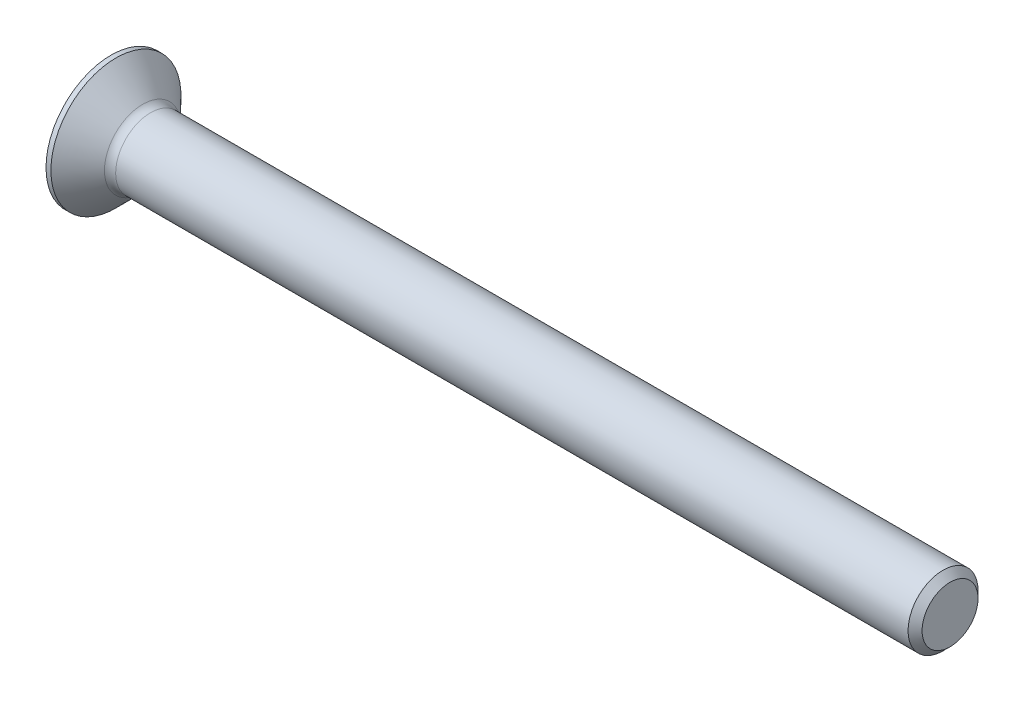
ISO-10303-21;
HEADER;
FILE_DESCRIPTION(('STEP AP214'),'2;1');
FILE_NAME('part.step','',(''),(''),'','','');
FILE_SCHEMA(('AUTOMOTIVE_DESIGN { 1 0 10303 214 1 1 1 1 }'));
ENDSEC;
DATA;
#1=APPLICATION_CONTEXT('core data for automotive mechanical design processes');
#2=APPLICATION_PROTOCOL_DEFINITION('international standard','automotive_design',2000,#1);
#3=PRODUCT_CONTEXT('',#1,'mechanical');
#4=PRODUCT('Part','Part','',(#3));
#5=PRODUCT_RELATED_PRODUCT_CATEGORY('part','',(#4));
#6=PRODUCT_DEFINITION_FORMATION('','',#4);
#7=PRODUCT_DEFINITION_CONTEXT('part definition',#1,'design');
#8=PRODUCT_DEFINITION('design','',#6,#7);
#9=PRODUCT_DEFINITION_SHAPE('','',#8);
#10=(LENGTH_UNIT() NAMED_UNIT(*) SI_UNIT(.MILLI.,.METRE.));
#11=(NAMED_UNIT(*) PLANE_ANGLE_UNIT() SI_UNIT($,.RADIAN.));
#12=(NAMED_UNIT(*) SI_UNIT($,.STERADIAN.) SOLID_ANGLE_UNIT());
#13=UNCERTAINTY_MEASURE_WITH_UNIT(LENGTH_MEASURE(1.E-05),#10,'distance_accuracy_value','');
#14=(GEOMETRIC_REPRESENTATION_CONTEXT(3) GLOBAL_UNCERTAINTY_ASSIGNED_CONTEXT((#13)) GLOBAL_UNIT_ASSIGNED_CONTEXT((#10,
#11,#12)) REPRESENTATION_CONTEXT('',''));
#15=CARTESIAN_POINT('',(0.,0.,0.));
#16=DIRECTION('',(0.,0.,1.));
#17=DIRECTION('',(1.,0.,0.));
#18=AXIS2_PLACEMENT_3D('',#15,#16,#17);
#19=CARTESIAN_POINT('',(2.5125,0.,0.175));
#20=DIRECTION('',(-0.128284441850094,0.,-0.991737415841114));
#21=DIRECTION('',(-0.991737415841114,0.,0.128284441850094));
#22=AXIS2_PLACEMENT_3D('',#19,#20,#21);
#23=PLANE('',#22);
#24=DIRECTION('',(0.983676315277952,0.127241712424014,-0.127241712424014));
#25=VECTOR('',#24,1.);
#26=CARTESIAN_POINT('',(2.53440381529471,-0.172166670658396,0.172166670658396));
#27=LINE('',#26,#25);
#28=CARTESIAN_POINT('',(0.,-0.500000000000002,0.5));
#29=VERTEX_POINT('',#28);
#30=CARTESIAN_POINT('',(0.0933920544055901,-0.487919435748532,0.487919435748531));
#31=VERTEX_POINT('',#30);
#32=EDGE_CURVE('E248',#29,#31,#27,.T.);
#33=ORIENTED_EDGE('',*,*,#32,.T.);
#34=CARTESIAN_POINT('',(1.34843941124888,0.,0.325575001529995));
#35=DIRECTION('',(-0.128284441850094,0.,-0.991737415841114));
#36=DIRECTION('',(-0.991737415841114,0.,0.128284441850094));
#37=AXIS2_PLACEMENT_3D('',#34,#35,#36);
#38=ELLIPSE('',#37,4.69473004047204,0.506674468622042);
#39=CARTESIAN_POINT('',(2.00843413054568,-0.501558079059028,0.240202550277674));
#40=VERTEX_POINT('',#39);
#41=EDGE_CURVE('E360',#31,#40,#38,.F.);
#42=ORIENTED_EDGE('',*,*,#41,.T.);
#43=DIRECTION('',(0.705906566979955,0.702394594009906,-0.0913112972212878));
#44=VECTOR('',#43,1.);
#45=CARTESIAN_POINT('',(0.,-2.5,0.5));
#46=LINE('',#45,#44);
#47=CARTESIAN_POINT('',(0.,-2.5,0.5));
#48=VERTEX_POINT('',#47);
#49=EDGE_CURVE('E266',#48,#40,#46,.T.);
#50=ORIENTED_EDGE('',*,*,#49,.F.);
#51=DIRECTION('',(0.,-1.,0.));
#52=VECTOR('',#51,1.);
#53=CARTESIAN_POINT('',(0.,2.5,0.5));
#54=LINE('',#53,#52);
#55=EDGE_CURVE('E254',#29,#48,#54,.T.);
#56=ORIENTED_EDGE('',*,*,#55,.F.);
#57=EDGE_LOOP('',(#33,#42,#50,#56));
#58=FACE_BOUND('',#57,.T.);
#59=ADVANCED_FACE('F35',(#58),#23,.T.);
#60=DIRECTION('',(0.705906566979955,-0.702394594009906,-0.0913112972212877));
#61=VECTOR('',#60,1.);
#62=CARTESIAN_POINT('',(0.,2.5,0.5));
#63=LINE('',#62,#61);
#64=CARTESIAN_POINT('',(0.,2.5,0.5));
#65=VERTEX_POINT('',#64);
#66=CARTESIAN_POINT('',(2.00843413054568,0.501558079059028,0.240202550277674));
#67=VERTEX_POINT('',#66);
#68=EDGE_CURVE('E272',#65,#67,#63,.T.);
#69=ORIENTED_EDGE('',*,*,#68,.T.);
#70=CARTESIAN_POINT('',(1.34843941124888,0.,0.325575001529995));
#71=DIRECTION('',(-0.128284441850094,0.,-0.991737415841114));
#72=DIRECTION('',(-0.991737415841114,0.,0.128284441850094));
#73=AXIS2_PLACEMENT_3D('',#70,#71,#72);
#74=ELLIPSE('',#73,4.69473004047204,0.506674468622042);
#75=CARTESIAN_POINT('',(0.595203223168208,0.499999999999998,0.423008538296887));
#76=VERTEX_POINT('',#75);
#77=EDGE_CURVE('E201',#67,#76,#74,.F.);
#78=ORIENTED_EDGE('',*,*,#77,.T.);
#79=DIRECTION('',(-0.991737415841114,0.,0.128284441850094));
#80=VECTOR('',#79,1.);
#81=CARTESIAN_POINT('',(2.5125,0.499999999999999,0.175));
#82=LINE('',#81,#80);
#83=CARTESIAN_POINT('',(0.,0.499999999999998,0.5));
#84=VERTEX_POINT('',#83);
#85=EDGE_CURVE('E58',#76,#84,#82,.T.);
#86=ORIENTED_EDGE('',*,*,#85,.T.);
#87=EDGE_CURVE('E256',#65,#84,#54,.T.);
#88=ORIENTED_EDGE('',*,*,#87,.F.);
#89=EDGE_LOOP('',(#69,#78,#86,#88));
#90=FACE_BOUND('',#89,.T.);
#91=ADVANCED_FACE('F154',(#90),#23,.T.);
#92=CARTESIAN_POINT('',(2.5125,0.,-0.5));
#93=DIRECTION('',(0.,0.,1.));
#94=DIRECTION('',(1.,0.,0.));
#95=AXIS2_PLACEMENT_3D('',#92,#93,#94);
#96=PLANE('',#95);
#97=DIRECTION('',(0.,1.,0.));
#98=VECTOR('',#97,1.);
#99=CARTESIAN_POINT('',(2.01,-0.5,-0.5));
#100=LINE('',#99,#98);
#101=CARTESIAN_POINT('',(2.01,-0.5,-0.5));
#102=VERTEX_POINT('',#101);
#103=CARTESIAN_POINT('',(2.01,-0.243178946457128,-0.5));
#104=VERTEX_POINT('',#103);
#105=EDGE_CURVE('E250',#102,#104,#100,.T.);
#106=ORIENTED_EDGE('',*,*,#105,.T.);
#107=CARTESIAN_POINT('',(-1.23691928728902,0.6026293694548,-0.499999999999999));
#108=CARTESIAN_POINT('',(-1.11561562433382,0.591605639928604,-0.5));
#109=CARTESIAN_POINT('',(-0.994322613848547,0.580463389267658,-0.5));
#110=CARTESIAN_POINT('',(-0.751761222922834,0.55788749673921,-0.5));
#111=CARTESIAN_POINT('',(-0.63049284303942,0.546453848891733,-0.5));
#112=CARTESIAN_POINT('',(-0.26596288602471,0.511560858493043,-0.5));
#113=CARTESIAN_POINT('',(-0.0227511377541281,0.487579161688623,-0.5));
#114=CARTESIAN_POINT('',(0.463457771562449,0.437531728297454,-0.5));
#115=CARTESIAN_POINT('',(0.706454937204167,0.41146603749468,-0.5));
#116=CARTESIAN_POINT('',(1.0702900177582,0.36965215069512,-0.5));
#117=CARTESIAN_POINT('',(1.19128593091325,0.355284078308905,-0.5));
#118=CARTESIAN_POINT('',(1.43309992283014,0.325237793879733,-0.5));
#119=CARTESIAN_POINT('',(1.55391802536947,0.309559777055056,-0.5));
#120=CARTESIAN_POINT('',(1.73483794998539,0.284522639869274,-0.5));
#121=CARTESIAN_POINT('',(1.79504576636324,0.27593098900372,-0.5));
#122=CARTESIAN_POINT('',(1.91538444981057,0.258069046699738,-0.5));
#123=CARTESIAN_POINT('',(1.97551528059357,0.248798507708491,-0.5));
#124=CARTESIAN_POINT('',(2.09605415619478,0.229257000179035,-0.5));
#125=CARTESIAN_POINT('',(2.15646112106136,0.218979370428262,-0.5));
#126=CARTESIAN_POINT('',(2.27696792354357,0.197054797886976,-0.5));
#127=CARTESIAN_POINT('',(2.33706802702325,0.18540938271671,-0.5));
#128=CARTESIAN_POINT('',(2.42701991257099,0.166118497993611,-0.5));
#129=CARTESIAN_POINT('',(2.45706327916659,0.159360695338501,-0.5));
#130=CARTESIAN_POINT('',(2.51704187875117,0.144967167205915,-0.5));
#131=CARTESIAN_POINT('',(2.54697657404877,0.13732903841906,-0.5));
#132=CARTESIAN_POINT('',(2.60615877439222,0.120741524747853,-0.5));
#133=CARTESIAN_POINT('',(2.63541005536398,0.111804718962496,-0.5));
#134=CARTESIAN_POINT('',(2.69312748082299,0.0917052052206415,-0.5));
#135=CARTESIAN_POINT('',(2.72159720125507,0.0805557403829888,-0.5));
#136=CARTESIAN_POINT('',(2.75519508164893,0.062585788799312,-0.5));
#137=CARTESIAN_POINT('',(2.76186567157059,0.0587577809715881,-0.5));
#138=CARTESIAN_POINT('',(2.77477562097652,0.0504556367476244,-0.5));
#139=CARTESIAN_POINT('',(2.78101678229069,0.045984478797429,-0.5));
#140=CARTESIAN_POINT('',(2.78928533856172,0.0389046333304156,-0.5));
#141=CARTESIAN_POINT('',(2.79166470692329,0.0367115396824687,-0.5));
#142=CARTESIAN_POINT('',(2.7962018824403,0.0320908227736749,-0.5));
#143=CARTESIAN_POINT('',(2.79835907812049,0.0296625861531432,-0.5));
#144=CARTESIAN_POINT('',(2.80236133407401,0.0244915564472292,-0.5));
#145=CARTESIAN_POINT('',(2.80420084344723,0.0217443492965116,-0.5));
#146=CARTESIAN_POINT('',(2.80731776136548,0.0159499667754434,-0.5));
#147=CARTESIAN_POINT('',(2.80859834586592,0.0129046099295171,-0.5));
#148=CARTESIAN_POINT('',(2.81002390777872,0.0077921661873142,-0.5));
#149=CARTESIAN_POINT('',(2.81041563150904,0.00579418187814088,-0.5));
#150=CARTESIAN_POINT('',(2.81085093354282,0.00176021450060035,-0.5));
#151=CARTESIAN_POINT('',(2.8108947121822,-0.000275746025234206,-0.5));
#152=CARTESIAN_POINT('',(2.81062876606833,-0.0043218550377088,-0.5));
#153=CARTESIAN_POINT('',(2.81031935706169,-0.00633202495738773,-0.5));
#154=CARTESIAN_POINT('',(2.80938295491137,-0.0102768155647138,-0.5));
#155=CARTESIAN_POINT('',(2.80875561324183,-0.0122113508275137,-0.5));
#156=CARTESIAN_POINT('',(2.8068863554394,-0.0168513747858365,-0.5));
#157=CARTESIAN_POINT('',(2.80549426973712,-0.0194957232505628,-0.5));
#158=CARTESIAN_POINT('',(2.8023220568522,-0.0245391702119726,-0.5));
#159=CARTESIAN_POINT('',(2.80054084214453,-0.0269375531192361,-0.5));
#160=CARTESIAN_POINT('',(2.79495497903153,-0.033636648490618,-0.5));
#161=CARTESIAN_POINT('',(2.79080344666467,-0.03764342426935,-0.5));
#162=CARTESIAN_POINT('',(2.78201988229077,-0.0450832169776907,-0.5));
#163=CARTESIAN_POINT('',(2.77738622956751,-0.048514190229306,-0.5));
#164=CARTESIAN_POINT('',(2.75503162264932,-0.0637586335916279,-0.5));
#165=CARTESIAN_POINT('',(2.73575329249511,-0.0731938920500581,-0.5));
#166=CARTESIAN_POINT('',(2.69640099909063,-0.0901480985209735,-0.5));
#167=CARTESIAN_POINT('',(2.67632257928831,-0.097653817083524,-0.5));
#168=CARTESIAN_POINT('',(2.61603371103578,-0.118307976834092,-0.5));
#169=CARTESIAN_POINT('',(2.57524922327944,-0.1298382546749,-0.5));
#170=CARTESIAN_POINT('',(2.49318496319165,-0.150998495708794,-0.5));
#171=CARTESIAN_POINT('',(2.45190443962289,-0.160625046170865,-0.5));
#172=CARTESIAN_POINT('',(2.36918183389703,-0.178637719632752,-0.5));
#173=CARTESIAN_POINT('',(2.32774050174067,-0.187027161200617,-0.5));
#174=CARTESIAN_POINT('',(2.24474333601662,-0.202993079661663,-0.5));
#175=CARTESIAN_POINT('',(2.20318762654411,-0.210570227758139,-0.5));
#176=CARTESIAN_POINT('',(2.07869623335323,-0.23237267141998,-0.5));
#177=CARTESIAN_POINT('',(1.99560932364642,-0.24573566678526,-0.5));
#178=CARTESIAN_POINT('',(1.82922135003294,-0.271064534870154,-0.5));
#179=CARTESIAN_POINT('',(1.74592026631388,-0.283030273206415,-0.5));
#180=CARTESIAN_POINT('',(1.49573272743823,-0.317517669199947,-0.5));
#181=CARTESIAN_POINT('',(1.32865072336044,-0.338615212022908,-0.5));
#182=CARTESIAN_POINT('',(0.994162174698123,-0.378720487628081,-0.5));
#183=CARTESIAN_POINT('',(0.82675551164306,-0.397727197069227,-0.5));
#184=CARTESIAN_POINT('',(0.491827589471963,-0.434345298682796,-0.5));
#185=CARTESIAN_POINT('',(0.324306364285921,-0.451957001432857,-0.5));
#186=CARTESIAN_POINT('',(0.0406140994057563,-0.480948499613969,-0.5));
#187=CARTESIAN_POINT('',(-0.0755313759258926,-0.492581483945596,-0.5));
#188=CARTESIAN_POINT('',(-0.30786742301528,-0.515466346738625,-0.5));
#189=CARTESIAN_POINT('',(-0.424057997187341,-0.52671820071243,-0.5));
#190=CARTESIAN_POINT('',(-0.656350429480037,-0.548897154711708,-0.5));
#191=CARTESIAN_POINT('',(-0.772452257184077,-0.559824574325141,-0.5));
#192=CARTESIAN_POINT('',(-1.00467257074282,-0.581413895420787,-0.5));
#193=CARTESIAN_POINT('',(-1.12079105490534,-0.592075815090887,-0.5));
#194=CARTESIAN_POINT('',(-1.23691928728867,-0.602629369454768,-0.499999999999999));
#195=B_SPLINE_CURVE_WITH_KNOTS('',3,(#107,#108,#109,#110,#111,#112,#113,#114,#115,#116,#117,
#118,#119,#120,#121,#122,#123,#124,#125,#126,#127,#128,#129,#130,#131,#132,#133,#134,#135,#136,
#137,#138,#139,#140,#141,#142,#143,#144,#145,#146,#147,#148,#149,#150,#151,#152,#153,#154,#155,
#156,#157,#158,#159,#160,#161,#162,#163,#164,#165,#166,#167,#168,#169,#170,#171,#172,#173,#174,
#175,#176,#177,#178,#179,#180,#181,#182,#183,#184,#185,#186,#187,#188,#189,#190,#191,#192,#193,
#194),.UNSPECIFIED.,.F.,.F.,(4,2,2,2,2,2,2,2,2,2,2,2,2,2,2,2,2,2,2,2,2,2,2,2,2,2,2,2,2,2,2,2,2,
2,2,2,2,2,2,2,2,2,2,4),(0.,0.365410715043971,0.730828934997472,1.46399866506185,
2.19715229229417,2.562686484017,2.92816629777617,3.11061708490367,3.29313473620163,
3.47695361965653,3.66056912177381,3.75294911265915,3.84558755931892,3.93738209198195,
4.02864294555837,4.05169698531311,4.07464750715284,4.0843440232281,4.09406655086394,
4.10394475350134,4.11376607074663,4.11984724928751,4.12592492622178,4.13199717401933,
4.13807609281432,4.14698960442295,4.15592835338455,4.1731406445108,4.19041279073947,
4.25431829846792,4.31865092879126,4.44559823084219,4.57277108309304,4.6995963309026,
4.82631596104916,5.07875451790751,5.3312173334722,5.8364125397922,6.3418539197847,
6.84718245256752,7.19736175144794,7.54756350681048,7.89740800374613,8.24722846852854),.UNSPECIFIED.);
#196=CARTESIAN_POINT('',(0.595203223168239,-0.423008538296644,-0.5));
#197=VERTEX_POINT('',#196);
#198=EDGE_CURVE('E175',#104,#197,#195,.T.);
#199=ORIENTED_EDGE('',*,*,#198,.T.);
#200=DIRECTION('',(-0.991737415841114,-0.128284441850094,0.));
#201=VECTOR('',#200,1.);
#202=CARTESIAN_POINT('',(2.53476428414928,-0.17212004284636,-0.5));
#203=LINE('',#202,#201);
#204=CARTESIAN_POINT('',(0.,-0.499999999999998,-0.5));
#205=VERTEX_POINT('',#204);
#206=EDGE_CURVE('E296',#197,#205,#203,.T.);
#207=ORIENTED_EDGE('',*,*,#206,.T.);
#208=DIRECTION('',(0.,1.,0.));
#209=VECTOR('',#208,1.);
#210=CARTESIAN_POINT('',(0.,-2.5,-0.5));
#211=LINE('',#210,#209);
#212=CARTESIAN_POINT('',(0.,-2.5,-0.5));
#213=VERTEX_POINT('',#212);
#214=EDGE_CURVE('E255',#213,#205,#211,.T.);
#215=ORIENTED_EDGE('',*,*,#214,.F.);
#216=DIRECTION('',(0.708867935568915,0.705341229421806,0.));
#217=VECTOR('',#216,1.);
#218=CARTESIAN_POINT('',(0.,-2.5,-0.5));
#219=LINE('',#218,#217);
#220=EDGE_CURVE('E269',#213,#102,#219,.T.);
#221=ORIENTED_EDGE('',*,*,#220,.T.);
#222=EDGE_LOOP('',(#106,#199,#207,#215,#221));
#223=FACE_BOUND('',#222,.T.);
#224=ADVANCED_FACE('F160',(#223),#96,.T.);
#225=CARTESIAN_POINT('',(2.01,0.5,-0.5));
#226=DIRECTION('',(1.,0.,0.));
#227=DIRECTION('',(0.,0.,-1.));
#228=AXIS2_PLACEMENT_3D('',#225,#226,#227);
#229=PLANE('',#228);
#230=CARTESIAN_POINT('',(2.01,0.,0.));
#231=DIRECTION('',(-1.,0.,0.));
#232=DIRECTION('',(0.,0.,1.));
#233=AXIS2_PLACEMENT_3D('',#230,#231,#232);
#234=CIRCLE('',#233,0.555999999999999);
#235=CARTESIAN_POINT('',(2.01,-0.5,-0.243178946457128));
#236=VERTEX_POINT('',#235);
#237=EDGE_CURVE('E363',#104,#236,#234,.T.);
#238=ORIENTED_EDGE('',*,*,#237,.F.);
#239=ORIENTED_EDGE('',*,*,#105,.F.);
#240=DIRECTION('',(0.,0.,-1.));
#241=VECTOR('',#240,1.);
#242=CARTESIAN_POINT('',(2.01,-0.5,0.24));
#243=LINE('',#242,#241);
#244=EDGE_CURVE('E278',#236,#102,#243,.T.);
#245=ORIENTED_EDGE('',*,*,#244,.F.);
#246=EDGE_LOOP('',(#238,#239,#245));
#247=FACE_BOUND('',#246,.T.);
#248=ADVANCED_FACE('F169',(#247),#229,.F.);
#249=CARTESIAN_POINT('',(2.01,0.243178946457126,0.500000000000001));
#250=VERTEX_POINT('',#249);
#251=CARTESIAN_POINT('',(2.01,0.499999999999999,0.24317894645713));
#252=VERTEX_POINT('',#251);
#253=EDGE_CURVE('E354',#250,#252,#234,.T.);
#254=ORIENTED_EDGE('',*,*,#253,.F.);
#255=DIRECTION('',(0.,-1.,0.));
#256=VECTOR('',#255,1.);
#257=CARTESIAN_POINT('',(2.01,0.499999999999998,0.500000000000002));
#258=LINE('',#257,#256);
#259=CARTESIAN_POINT('',(2.01,0.499999999999998,0.500000000000002));
#260=VERTEX_POINT('',#259);
#261=EDGE_CURVE('E227',#260,#250,#258,.T.);
#262=ORIENTED_EDGE('',*,*,#261,.F.);
#263=DIRECTION('',(0.,0.,1.));
#264=VECTOR('',#263,1.);
#265=CARTESIAN_POINT('',(2.01,0.500000000000002,-0.499999999999998));
#266=LINE('',#265,#264);
#267=EDGE_CURVE('E182',#252,#260,#266,.T.);
#268=ORIENTED_EDGE('',*,*,#267,.F.);
#269=EDGE_LOOP('',(#254,#262,#268));
#270=FACE_BOUND('',#269,.T.);
#271=ADVANCED_FACE('F353',(#270),#229,.F.);
#272=CARTESIAN_POINT('',(2.01,0.5,-0.243178946457128));
#273=VERTEX_POINT('',#272);
#274=CARTESIAN_POINT('',(2.01,0.243178946457129,-0.499999999999999));
#275=VERTEX_POINT('',#274);
#276=EDGE_CURVE('E362',#273,#275,#234,.T.);
#277=ORIENTED_EDGE('',*,*,#276,.F.);
#278=DIRECTION('',(0.,0.,1.));
#279=VECTOR('',#278,1.);
#280=CARTESIAN_POINT('',(2.01,0.5,-0.5));
#281=LINE('',#280,#279);
#282=CARTESIAN_POINT('',(2.01,0.5,-0.5));
#283=VERTEX_POINT('',#282);
#284=EDGE_CURVE('E279',#283,#273,#281,.T.);
#285=ORIENTED_EDGE('',*,*,#284,.F.);
#286=DIRECTION('',(0.,1.,0.));
#287=VECTOR('',#286,1.);
#288=CARTESIAN_POINT('',(2.01,-0.239999999999998,-0.500000000000001));
#289=LINE('',#288,#287);
#290=EDGE_CURVE('E236',#275,#283,#289,.T.);
#291=ORIENTED_EDGE('',*,*,#290,.F.);
#292=EDGE_LOOP('',(#277,#285,#291));
#293=FACE_BOUND('',#292,.T.);
#294=ADVANCED_FACE('F379',(#293),#229,.F.);
#295=CARTESIAN_POINT('',(2.01,-0.5,-0.5));
#296=DIRECTION('',(-0.705341229421806,0.708867935568915,0.));
#297=DIRECTION('',(-0.708867935568915,-0.705341229421806,0.));
#298=AXIS2_PLACEMENT_3D('',#295,#296,#297);
#299=PLANE('',#298);
#300=ORIENTED_EDGE('',*,*,#49,.T.);
#301=CARTESIAN_POINT('',(2.47553007760964,-0.036785992428222,0.));
#302=DIRECTION('',(-0.705341229421806,0.708867935568915,0.));
#303=DIRECTION('',(-0.708867935568915,-0.705341229421806,0.));
#304=AXIS2_PLACEMENT_3D('',#301,#302,#303);
#305=ELLIPSE('',#304,0.742118770283759,0.522152771490932);
#306=EDGE_CURVE('E202',#40,#236,#305,.F.);
#307=ORIENTED_EDGE('',*,*,#306,.T.);
#308=ORIENTED_EDGE('',*,*,#244,.T.);
#309=ORIENTED_EDGE('',*,*,#220,.F.);
#310=DIRECTION('',(0.,0.,-1.));
#311=VECTOR('',#310,1.);
#312=CARTESIAN_POINT('',(0.,-2.5,0.5));
#313=LINE('',#312,#311);
#314=EDGE_CURVE('E259',#48,#213,#313,.T.);
#315=ORIENTED_EDGE('',*,*,#314,.F.);
#316=EDGE_LOOP('',(#300,#307,#308,#309,#315));
#317=FACE_BOUND('',#316,.T.);
#318=ADVANCED_FACE('F164',(#317),#299,.T.);
#319=CARTESIAN_POINT('',(0.,2.5,0.5));
#320=DIRECTION('',(-0.705341229421806,-0.708867935568915,0.));
#321=DIRECTION('',(0.708867935568915,-0.705341229421806,0.));
#322=AXIS2_PLACEMENT_3D('',#319,#320,#321);
#323=PLANE('',#322);
#324=ORIENTED_EDGE('',*,*,#284,.T.);
#325=CARTESIAN_POINT('',(2.47553007760964,0.0367859924282221,0.));
#326=DIRECTION('',(-0.705341229421806,-0.708867935568915,0.));
#327=DIRECTION('',(-0.708867935568915,0.705341229421806,0.));
#328=AXIS2_PLACEMENT_3D('',#325,#326,#327);
#329=ELLIPSE('',#328,0.742118770283758,0.522152771490932);
#330=EDGE_CURVE('E378',#273,#67,#329,.F.);
#331=ORIENTED_EDGE('',*,*,#330,.T.);
#332=ORIENTED_EDGE('',*,*,#68,.F.);
#333=DIRECTION('',(0.,0.,1.));
#334=VECTOR('',#333,1.);
#335=CARTESIAN_POINT('',(0.,2.5,-0.5));
#336=LINE('',#335,#334);
#337=CARTESIAN_POINT('',(0.,2.5,-0.5));
#338=VERTEX_POINT('',#337);
#339=EDGE_CURVE('E251',#338,#65,#336,.T.);
#340=ORIENTED_EDGE('',*,*,#339,.F.);
#341=DIRECTION('',(0.708867935568915,-0.705341229421806,0.));
#342=VECTOR('',#341,1.);
#343=CARTESIAN_POINT('',(0.,2.5,-0.5));
#344=LINE('',#343,#342);
#345=EDGE_CURVE('E275',#338,#283,#344,.T.);
#346=ORIENTED_EDGE('',*,*,#345,.T.);
#347=EDGE_LOOP('',(#324,#331,#332,#340,#346));
#348=FACE_BOUND('',#347,.T.);
#349=ADVANCED_FACE('F172',(#348),#323,.T.);
#350=CARTESIAN_POINT('',(2.5125,-0.175,0.));
#351=DIRECTION('',(-0.128284441850094,0.991737415841114,0.));
#352=DIRECTION('',(-0.991737415841114,-0.128284441850094,0.));
#353=AXIS2_PLACEMENT_3D('',#350,#351,#352);
#354=PLANE('',#353);
#355=ORIENTED_EDGE('',*,*,#206,.F.);
#356=CARTESIAN_POINT('',(1.34843941124888,-0.325575001529995,0.));
#357=DIRECTION('',(-0.128284441850094,0.991737415841114,0.));
#358=DIRECTION('',(-0.991737415841114,-0.128284441850094,0.));
#359=AXIS2_PLACEMENT_3D('',#356,#357,#358);
#360=ELLIPSE('',#359,4.69473004047204,0.506674468622042);
#361=CARTESIAN_POINT('',(2.00843413054568,-0.240202550277672,-0.50155807905903));
#362=VERTEX_POINT('',#361);
#363=EDGE_CURVE('E183',#197,#362,#360,.F.);
#364=ORIENTED_EDGE('',*,*,#363,.T.);
#365=DIRECTION('',(0.705906566979955,0.0913112972212854,0.702394594009906));
#366=VECTOR('',#365,1.);
#367=CARTESIAN_POINT('',(0.,-0.499999999999992,-2.5));
#368=LINE('',#367,#366);
#369=CARTESIAN_POINT('',(0.,-0.499999999999992,-2.5));
#370=VERTEX_POINT('',#369);
#371=EDGE_CURVE('E336',#370,#362,#368,.T.);
#372=ORIENTED_EDGE('',*,*,#371,.F.);
#373=DIRECTION('',(0.,0.,-1.));
#374=VECTOR('',#373,1.);
#375=CARTESIAN_POINT('',(0.,-0.500000000000009,2.5));
#376=LINE('',#375,#374);
#377=EDGE_CURVE('E329',#205,#370,#376,.T.);
#378=ORIENTED_EDGE('',*,*,#377,.F.);
#379=EDGE_LOOP('',(#355,#364,#372,#378));
#380=FACE_BOUND('',#379,.T.);
#381=ADVANCED_FACE('F211',(#380),#354,.T.);
#382=CARTESIAN_POINT('',(2.01,0.500000000000002,-0.499999999999998));
#383=DIRECTION('',(-0.705341229421806,0.,0.708867935568915));
#384=DIRECTION('',(-0.708867935568915,0.,-0.705341229421806));
#385=AXIS2_PLACEMENT_3D('',#382,#383,#384);
#386=PLANE('',#385);
#387=ORIENTED_EDGE('',*,*,#371,.T.);
#388=CARTESIAN_POINT('',(2.47553007760964,0.,-0.036785992428222));
#389=DIRECTION('',(-0.705341229421806,0.,0.708867935568915));
#390=DIRECTION('',(-0.708867935568915,0.,-0.705341229421806));
#391=AXIS2_PLACEMENT_3D('',#388,#389,#390);
#392=ELLIPSE('',#391,0.742118770283759,0.522152771490932);
#393=EDGE_CURVE('E376',#362,#275,#392,.F.);
#394=ORIENTED_EDGE('',*,*,#393,.T.);
#395=ORIENTED_EDGE('',*,*,#290,.T.);
#396=DIRECTION('',(0.708867935568915,0.,0.705341229421806));
#397=VECTOR('',#396,1.);
#398=CARTESIAN_POINT('',(0.,0.500000000000009,-2.5));
#399=LINE('',#398,#397);
#400=CARTESIAN_POINT('',(0.,0.500000000000009,-2.5));
#401=VERTEX_POINT('',#400);
#402=EDGE_CURVE('E347',#401,#283,#399,.T.);
#403=ORIENTED_EDGE('',*,*,#402,.F.);
#404=DIRECTION('',(0.,1.,0.));
#405=VECTOR('',#404,1.);
#406=CARTESIAN_POINT('',(0.,-0.499999999999992,-2.5));
#407=LINE('',#406,#405);
#408=EDGE_CURVE('E246',#370,#401,#407,.T.);
#409=ORIENTED_EDGE('',*,*,#408,.F.);
#410=EDGE_LOOP('',(#387,#394,#395,#403,#409));
#411=FACE_BOUND('',#410,.T.);
#412=ADVANCED_FACE('F189',(#411),#386,.T.);
#413=DIRECTION('',(0.705906566979955,0.0913112972212901,-0.702394594009905));
#414=VECTOR('',#413,1.);
#415=CARTESIAN_POINT('',(0.,-0.500000000000009,2.5));
#416=LINE('',#415,#414);
#417=CARTESIAN_POINT('',(0.,-0.500000000000009,2.5));
#418=VERTEX_POINT('',#417);
#419=CARTESIAN_POINT('',(2.00843413054568,-0.240202550277675,0.501558079059027));
#420=VERTEX_POINT('',#419);
#421=EDGE_CURVE('E349',#418,#420,#416,.T.);
#422=ORIENTED_EDGE('',*,*,#421,.T.);
#423=CARTESIAN_POINT('',(1.34843941124888,-0.325575001529995,0.));
#424=DIRECTION('',(-0.128284441850094,0.991737415841114,0.));
#425=DIRECTION('',(-0.991737415841114,-0.128284441850094,0.));
#426=AXIS2_PLACEMENT_3D('',#423,#424,#425);
#427=ELLIPSE('',#426,4.69473004047204,0.506674468622042);
#428=EDGE_CURVE('E50',#420,#31,#427,.F.);
#429=ORIENTED_EDGE('',*,*,#428,.T.);
#430=ORIENTED_EDGE('',*,*,#32,.F.);
#431=EDGE_CURVE('E337',#418,#29,#376,.T.);
#432=ORIENTED_EDGE('',*,*,#431,.F.);
#433=EDGE_LOOP('',(#422,#429,#430,#432));
#434=FACE_BOUND('',#433,.T.);
#435=ADVANCED_FACE('F222',(#434),#354,.T.);
#436=CARTESIAN_POINT('',(2.5125,0.5,0.));
#437=DIRECTION('',(0.,-1.,0.));
#438=DIRECTION('',(1.,0.,0.));
#439=AXIS2_PLACEMENT_3D('',#436,#437,#438);
#440=PLANE('',#439);
#441=ORIENTED_EDGE('',*,*,#85,.F.);
#442=CARTESIAN_POINT('',(-1.23691928728868,0.499999999999997,0.602629369454771));
#443=CARTESIAN_POINT('',(-1.11561562433349,0.499999999999997,0.591605639928575));
#444=CARTESIAN_POINT('',(-0.994322613848212,0.499999999999997,0.580463389267629));
#445=CARTESIAN_POINT('',(-0.751761222922508,0.499999999999998,0.557887496739181));
#446=CARTESIAN_POINT('',(-0.630492843039099,0.499999999999998,0.546453848891704));
#447=CARTESIAN_POINT('',(-0.265962886024399,0.499999999999998,0.511560858493014));
#448=CARTESIAN_POINT('',(-0.022751137753823,0.499999999999998,0.487579161688594));
#449=CARTESIAN_POINT('',(0.463457771562742,0.499999999999998,0.437531728297425));
#450=CARTESIAN_POINT('',(0.706454937204454,0.499999999999998,0.411466037494651));
#451=CARTESIAN_POINT('',(1.07029001775847,0.499999999999999,0.369652150695089));
#452=CARTESIAN_POINT('',(1.19128593091352,0.499999999999999,0.355284078308874));
#453=CARTESIAN_POINT('',(1.4330999228304,0.499999999999999,0.325237793879701));
#454=CARTESIAN_POINT('',(1.55391802536973,0.499999999999999,0.309559777055023));
#455=CARTESIAN_POINT('',(1.73483794998564,0.499999999999999,0.28452263986924));
#456=CARTESIAN_POINT('',(1.79504576636348,0.499999999999999,0.275930989003685));
#457=CARTESIAN_POINT('',(1.91538444981081,0.499999999999999,0.258069046699703));
#458=CARTESIAN_POINT('',(1.97551528059381,0.499999999999999,0.248798507708455));
#459=CARTESIAN_POINT('',(2.09605415619502,0.499999999999999,0.229257000178997));
#460=CARTESIAN_POINT('',(2.15646112106159,0.499999999999999,0.218979370428223));
#461=CARTESIAN_POINT('',(2.2769679235438,0.499999999999999,0.197054797886934));
#462=CARTESIAN_POINT('',(2.33706802702348,0.499999999999999,0.185409382716665));
#463=CARTESIAN_POINT('',(2.42701991257122,0.499999999999999,0.166118497993562));
#464=CARTESIAN_POINT('',(2.45706327916682,0.499999999999999,0.15936069533845));
#465=CARTESIAN_POINT('',(2.51704187875139,0.499999999999999,0.14496716720586));
#466=CARTESIAN_POINT('',(2.546976574049,0.5,0.137329038419002));
#467=CARTESIAN_POINT('',(2.60615877439245,0.5,0.120741524747787));
#468=CARTESIAN_POINT('',(2.6354100553642,0.5,0.111804718962426));
#469=CARTESIAN_POINT('',(2.69312748082321,0.5,0.0917052052205605));
#470=CARTESIAN_POINT('',(2.72159720125529,0.5,0.0805557403829021));
#471=CARTESIAN_POINT('',(2.75519508164913,0.5,0.0625857887992012));
#472=CARTESIAN_POINT('',(2.76186567157078,0.5,0.0587577809714713));
#473=CARTESIAN_POINT('',(2.77477562097671,0.5,0.0504556367474944));
#474=CARTESIAN_POINT('',(2.78101678229088,0.5,0.0459844787972917));
#475=CARTESIAN_POINT('',(2.78928533856188,0.5,0.0389046333302752));
#476=CARTESIAN_POINT('',(2.79166470692343,0.5,0.0367115396823366));
#477=CARTESIAN_POINT('',(2.79620188244041,0.5,0.032090822773562));
#478=CARTESIAN_POINT('',(2.79835907812057,0.5,0.0296625861530412));
#479=CARTESIAN_POINT('',(2.80236133407407,0.5,0.0244915564471516));
#480=CARTESIAN_POINT('',(2.80420084344726,0.5,0.0217443492964475));
#481=CARTESIAN_POINT('',(2.80731776136549,0.5,0.015949966775411));
#482=CARTESIAN_POINT('',(2.80859834586592,0.5,0.0129046099295028));
#483=CARTESIAN_POINT('',(2.81002390777872,0.5,0.00779216618731896));
#484=CARTESIAN_POINT('',(2.81041563150904,0.5,0.00579418187814544));
#485=CARTESIAN_POINT('',(2.81085093354282,0.5,0.00176021450060503));
#486=CARTESIAN_POINT('',(2.8108947121822,0.5,-0.000275746025229203));
#487=CARTESIAN_POINT('',(2.81062876606833,0.5,-0.0043218550377036));
#488=CARTESIAN_POINT('',(2.81031935706169,0.5,-0.00633202495738266));
#489=CARTESIAN_POINT('',(2.80938295491137,0.5,-0.0102768155647088));
#490=CARTESIAN_POINT('',(2.80875561324183,0.5,-0.0122113508275086));
#491=CARTESIAN_POINT('',(2.8068863554394,0.5,-0.0168513747858306));
#492=CARTESIAN_POINT('',(2.80549426973712,0.5,-0.0194957232505563));
#493=CARTESIAN_POINT('',(2.8023220568522,0.5,-0.0245391702119656));
#494=CARTESIAN_POINT('',(2.80054084214454,0.5,-0.026937553119229));
#495=CARTESIAN_POINT('',(2.79495497903153,0.5,-0.0336366484906095));
#496=CARTESIAN_POINT('',(2.79080344666468,0.5,-0.0376434242693403));
#497=CARTESIAN_POINT('',(2.78201988229077,0.5,-0.0450832169776796));
#498=CARTESIAN_POINT('',(2.77738622956752,0.5,-0.0485141902292948));
#499=CARTESIAN_POINT('',(2.75503162264934,0.5,-0.0637586335916136));
#500=CARTESIAN_POINT('',(2.73575329249514,0.5,-0.0731938920500419));
#501=CARTESIAN_POINT('',(2.69640099909067,0.5,-0.0901480985209534));
#502=CARTESIAN_POINT('',(2.67632257928837,0.5,-0.0976538170835018));
#503=CARTESIAN_POINT('',(2.61603371103586,0.5,-0.118307976834065));
#504=CARTESIAN_POINT('',(2.57524922327954,0.500000000000001,-0.12983825467487));
#505=CARTESIAN_POINT('',(2.49318496319179,0.500000000000001,-0.150998495708759));
#506=CARTESIAN_POINT('',(2.45190443962304,0.500000000000001,-0.160625046170827));
#507=CARTESIAN_POINT('',(2.36918183389722,0.500000000000001,-0.178637719632711));
#508=CARTESIAN_POINT('',(2.32774050174088,0.500000000000001,-0.187027161200573));
#509=CARTESIAN_POINT('',(2.24474333601687,0.500000000000001,-0.202993079661616));
#510=CARTESIAN_POINT('',(2.20318762654437,0.500000000000001,-0.21057022775809));
#511=CARTESIAN_POINT('',(2.07869623335355,0.500000000000001,-0.232372671419926));
#512=CARTESIAN_POINT('',(1.99560932364677,0.500000000000001,-0.245735666785202));
#513=CARTESIAN_POINT('',(1.82922135003336,0.500000000000001,-0.271064534870091));
#514=CARTESIAN_POINT('',(1.74592026631434,0.500000000000001,-0.283030273206349));
#515=CARTESIAN_POINT('',(1.49573272743879,0.500000000000001,-0.317517669199872));
#516=CARTESIAN_POINT('',(1.32865072336107,0.500000000000001,-0.338615212022827));
#517=CARTESIAN_POINT('',(0.994162174698896,0.500000000000001,-0.37872048762799));
#518=CARTESIAN_POINT('',(0.826755511643904,0.500000000000001,-0.397727197069131));
#519=CARTESIAN_POINT('',(0.491827589472949,0.500000000000001,-0.434345298682689));
#520=CARTESIAN_POINT('',(0.324306364286978,0.500000000000001,-0.451957001432745));
#521=CARTESIAN_POINT('',(0.040614099406787,0.500000000000001,-0.480948499613864));
#522=CARTESIAN_POINT('',(-0.0755313759249599,0.500000000000001,-0.492581483945501));
#523=CARTESIAN_POINT('',(-0.307867423014543,0.500000000000001,-0.515466346738552));
#524=CARTESIAN_POINT('',(-0.424057997186702,0.500000000000002,-0.526718200712367));
#525=CARTESIAN_POINT('',(-0.656350429479595,0.500000000000002,-0.548897154711665));
#526=CARTESIAN_POINT('',(-0.772452257183733,0.500000000000002,-0.559824574325108));
#527=CARTESIAN_POINT('',(-1.00467257074267,0.500000000000002,-0.581413895420771));
#528=CARTESIAN_POINT('',(-1.12079105490529,0.500000000000002,-0.592075815090881));
#529=CARTESIAN_POINT('',(-1.23691928728872,0.500000000000002,-0.602629369454771));
#530=B_SPLINE_CURVE_WITH_KNOTS('',3,(#442,#443,#444,#445,#446,#447,#448,#449,#450,#451,#452,
#453,#454,#455,#456,#457,#458,#459,#460,#461,#462,#463,#464,#465,#466,#467,#468,#469,#470,#471,
#472,#473,#474,#475,#476,#477,#478,#479,#480,#481,#482,#483,#484,#485,#486,#487,#488,#489,#490,
#491,#492,#493,#494,#495,#496,#497,#498,#499,#500,#501,#502,#503,#504,#505,#506,#507,#508,#509,
#510,#511,#512,#513,#514,#515,#516,#517,#518,#519,#520,#521,#522,#523,#524,#525,#526,#527,#528,
#529),.UNSPECIFIED.,.F.,.F.,(4,2,2,2,2,2,2,2,2,2,2,2,2,2,2,2,2,2,2,2,2,2,2,2,2,2,2,2,2,2,2,2,2,
2,2,2,2,2,2,2,2,2,2,4),(0.,0.365410715043957,0.730828934997445,1.46399866506181,
2.19715229229411,2.56268648401692,2.92816629777609,3.11061708490358,3.29313473620152,
3.47695361965642,3.6605691217737,3.75294911265904,3.84558755931881,3.93738209198184,
4.02864294555825,4.051696985313,4.07464750715273,4.08434402322793,4.09406655086371,
4.10394475350104,4.11376607074628,4.11984724928716,4.12592492622143,4.13199717401897,
4.13807609281397,4.1469896044226,4.1559283533842,4.17314064451044,4.19041279073911,
4.25431829846754,4.31865092879084,4.44559823084172,4.57277108309252,4.69959633090203,
4.82631596104853,5.07875451790677,5.33121733347136,5.83641253979114,6.34185391978343,
6.84718245256603,7.19736175144676,7.54756350680959,7.89740800374553,8.24722846852824),.UNSPECIFIED.);
#531=EDGE_CURVE('E193',#76,#252,#530,.T.);
#532=ORIENTED_EDGE('',*,*,#531,.T.);
#533=ORIENTED_EDGE('',*,*,#267,.T.);
#534=DIRECTION('',(0.708867935568915,0.,-0.705341229421806));
#535=VECTOR('',#534,1.);
#536=CARTESIAN_POINT('',(0.,0.499999999999991,2.5));
#537=LINE('',#536,#535);
#538=CARTESIAN_POINT('',(0.,0.499999999999991,2.5));
#539=VERTEX_POINT('',#538);
#540=EDGE_CURVE('E232',#539,#260,#537,.T.);
#541=ORIENTED_EDGE('',*,*,#540,.F.);
#542=DIRECTION('',(0.,0.,1.));
#543=VECTOR('',#542,1.);
#544=CARTESIAN_POINT('',(0.,0.500000000000009,-2.5));
#545=LINE('',#544,#543);
#546=EDGE_CURVE('E345',#84,#539,#545,.T.);
#547=ORIENTED_EDGE('',*,*,#546,.F.);
#548=EDGE_LOOP('',(#441,#532,#533,#541,#547));
#549=FACE_BOUND('',#548,.T.);
#550=ADVANCED_FACE('F210',(#549),#440,.T.);
#551=CARTESIAN_POINT('',(0.,-0.500000000000009,2.5));
#552=DIRECTION('',(-0.705341229421806,0.,-0.708867935568915));
#553=DIRECTION('',(0.708867935568915,0.,-0.705341229421806));
#554=AXIS2_PLACEMENT_3D('',#551,#552,#553);
#555=PLANE('',#554);
#556=ORIENTED_EDGE('',*,*,#261,.T.);
#557=CARTESIAN_POINT('',(2.47553007760964,0.,0.0367859924282221));
#558=DIRECTION('',(-0.705341229421806,0.,-0.708867935568915));
#559=DIRECTION('',(-0.708867935568915,0.,0.705341229421806));
#560=AXIS2_PLACEMENT_3D('',#557,#558,#559);
#561=ELLIPSE('',#560,0.742118770283758,0.522152771490932);
#562=EDGE_CURVE('E229',#250,#420,#561,.F.);
#563=ORIENTED_EDGE('',*,*,#562,.T.);
#564=ORIENTED_EDGE('',*,*,#421,.F.);
#565=DIRECTION('',(0.,-1.,0.));
#566=VECTOR('',#565,1.);
#567=CARTESIAN_POINT('',(0.,0.499999999999991,2.5));
#568=LINE('',#567,#566);
#569=EDGE_CURVE('E185',#539,#418,#568,.T.);
#570=ORIENTED_EDGE('',*,*,#569,.F.);
#571=ORIENTED_EDGE('',*,*,#540,.T.);
#572=EDGE_LOOP('',(#556,#563,#564,#570,#571));
#573=FACE_BOUND('',#572,.T.);
#574=ADVANCED_FACE('F212',(#573),#555,.T.);
#575=CARTESIAN_POINT('',(0.,0.,0.));
#576=DIRECTION('',(-1.,0.,0.));
#577=DIRECTION('',(0.,0.,1.));
#578=AXIS2_PLACEMENT_3D('',#575,#576,#577);
#579=PLANE('',#578);
#580=CARTESIAN_POINT('',(0.,0.,0.));
#581=DIRECTION('',(-1.,0.,0.));
#582=DIRECTION('',(0.,0.,1.));
#583=AXIS2_PLACEMENT_3D('',#580,#581,#582);
#584=CIRCLE('',#583,4.65);
#585=CARTESIAN_POINT('',(0.,0.,4.65));
#586=VERTEX_POINT('',#585);
#587=EDGE_CURVE('E287',#586,#586,#584,.T.);
#588=ORIENTED_EDGE('',*,*,#587,.T.);
#589=EDGE_LOOP('',(#588));
#590=FACE_BOUND('',#589,.T.);
#591=ORIENTED_EDGE('',*,*,#214,.T.);
#592=ORIENTED_EDGE('',*,*,#377,.T.);
#593=ORIENTED_EDGE('',*,*,#408,.T.);
#594=CARTESIAN_POINT('',(0.,0.500000000000002,-0.5));
#595=VERTEX_POINT('',#594);
#596=EDGE_CURVE('E340',#401,#595,#545,.T.);
#597=ORIENTED_EDGE('',*,*,#596,.T.);
#598=EDGE_CURVE('E265',#595,#338,#211,.T.);
#599=ORIENTED_EDGE('',*,*,#598,.T.);
#600=ORIENTED_EDGE('',*,*,#339,.T.);
#601=ORIENTED_EDGE('',*,*,#87,.T.);
#602=ORIENTED_EDGE('',*,*,#546,.T.);
#603=ORIENTED_EDGE('',*,*,#569,.T.);
#604=ORIENTED_EDGE('',*,*,#431,.T.);
#605=ORIENTED_EDGE('',*,*,#55,.T.);
#606=ORIENTED_EDGE('',*,*,#314,.T.);
#607=EDGE_LOOP('',(#591,#592,#593,#597,#599,#600,#601,#602,#603,#604,#605,#606));
#608=FACE_BOUND('',#607,.T.);
#609=ADVANCED_FACE('F214',(#590,#608),#579,.T.);
#610=ORIENTED_EDGE('',*,*,#598,.F.);
#611=DIRECTION('',(1.,0.,0.));
#612=VECTOR('',#611,1.);
#613=CARTESIAN_POINT('',(2.5125,0.500000000000002,-0.5));
#614=LINE('',#613,#612);
#615=EDGE_CURVE('E243',#595,#283,#614,.T.);
#616=ORIENTED_EDGE('',*,*,#615,.T.);
#617=ORIENTED_EDGE('',*,*,#345,.F.);
#618=EDGE_LOOP('',(#610,#616,#617));
#619=FACE_BOUND('',#618,.T.);
#620=ADVANCED_FACE('F171',(#619),#96,.T.);
#621=CARTESIAN_POINT('',(-6.34999999999999,0.,0.));
#622=DIRECTION('',(-1.,0.,0.));
#623=DIRECTION('',(0.,0.,1.));
#624=AXIS2_PLACEMENT_3D('',#621,#622,#623);
#625=CYLINDRICAL_SURFACE('',#624,4.65);
#626=CARTESIAN_POINT('',(0.350000000000007,0.,0.));
#627=DIRECTION('',(-1.,0.,0.));
#628=DIRECTION('',(0.,0.,1.));
#629=AXIS2_PLACEMENT_3D('',#626,#627,#628);
#630=CIRCLE('',#629,4.65);
#631=CARTESIAN_POINT('',(0.350000000000007,0.,4.65));
#632=VERTEX_POINT('',#631);
#633=EDGE_CURVE('E262',#632,#632,#630,.T.);
#634=ORIENTED_EDGE('',*,*,#633,.T.);
#635=EDGE_LOOP('',(#634));
#636=FACE_BOUND('',#635,.T.);
#637=ORIENTED_EDGE('',*,*,#587,.F.);
#638=EDGE_LOOP('',(#637));
#639=FACE_BOUND('',#638,.T.);
#640=ADVANCED_FACE('F316',(#636,#639),#625,.T.);
#641=CARTESIAN_POINT('',(0.350000000000007,0.,0.));
#642=DIRECTION('',(-1.,0.,0.));
#643=DIRECTION('',(0.,0.,1.));
#644=AXIS2_PLACEMENT_3D('',#641,#642,#643);
#645=CONICAL_SURFACE('',#644,4.65,0.78539816339745);
#646=CARTESIAN_POINT('',(2.26568542494924,0.,0.));
#647=DIRECTION('',(-1.,0.,0.));
#648=DIRECTION('',(0.,0.,1.));
#649=AXIS2_PLACEMENT_3D('',#646,#647,#648);
#650=CIRCLE('',#649,2.73431457505076);
#651=CARTESIAN_POINT('',(2.26568542494924,0.,2.73431457505076));
#652=VERTEX_POINT('',#651);
#653=EDGE_CURVE('E290',#652,#652,#650,.T.);
#654=ORIENTED_EDGE('',*,*,#653,.T.);
#655=EDGE_LOOP('',(#654));
#656=FACE_BOUND('',#655,.T.);
#657=ORIENTED_EDGE('',*,*,#633,.F.);
#658=EDGE_LOOP('',(#657));
#659=FACE_BOUND('',#658,.T.);
#660=ADVANCED_FACE('F306',(#656,#659),#645,.T.);
#661=CARTESIAN_POINT('',(-6.34999999999999,0.,0.));
#662=DIRECTION('',(-1.,0.,0.));
#663=DIRECTION('',(0.,0.,1.));
#664=AXIS2_PLACEMENT_3D('',#661,#662,#663);
#665=CYLINDRICAL_SURFACE('',#664,2.5);
#666=CARTESIAN_POINT('',(59.5,0.,0.));
#667=DIRECTION('',(1.,0.,0.));
#668=DIRECTION('',(0.,0.,-1.));
#669=AXIS2_PLACEMENT_3D('',#666,#667,#668);
#670=CIRCLE('',#669,2.5);
#671=CARTESIAN_POINT('',(59.5,0.,-2.5));
#672=VERTEX_POINT('',#671);
#673=EDGE_CURVE('E43',#672,#672,#670,.F.);
#674=ORIENTED_EDGE('',*,*,#673,.T.);
#675=EDGE_LOOP('',(#674));
#676=FACE_BOUND('',#675,.T.);
#677=CARTESIAN_POINT('',(2.83137084989848,0.,0.));
#678=DIRECTION('',(-1.,0.,0.));
#679=DIRECTION('',(0.,0.,1.));
#680=AXIS2_PLACEMENT_3D('',#677,#678,#679);
#681=CIRCLE('',#680,2.5);
#682=CARTESIAN_POINT('',(2.83137084989848,0.,2.5));
#683=VERTEX_POINT('',#682);
#684=EDGE_CURVE('E293',#683,#683,#681,.F.);
#685=ORIENTED_EDGE('',*,*,#684,.T.);
#686=EDGE_LOOP('',(#685));
#687=FACE_BOUND('',#686,.T.);
#688=ADVANCED_FACE('F301',(#676,#687),#665,.T.);
#689=CARTESIAN_POINT('',(60.,2.5,0.));
#690=DIRECTION('',(1.,0.,0.));
#691=DIRECTION('',(0.,0.,-1.));
#692=AXIS2_PLACEMENT_3D('',#689,#690,#691);
#693=PLANE('',#692);
#694=CARTESIAN_POINT('',(60.,0.,0.));
#695=DIRECTION('',(1.,0.,0.));
#696=DIRECTION('',(0.,0.,-1.));
#697=AXIS2_PLACEMENT_3D('',#694,#695,#696);
#698=CIRCLE('',#697,2.00000000000001);
#699=CARTESIAN_POINT('',(60.,0.,-2.00000000000001));
#700=VERTEX_POINT('',#699);
#701=EDGE_CURVE('E11',#700,#700,#698,.T.);
#702=ORIENTED_EDGE('',*,*,#701,.T.);
#703=EDGE_LOOP('',(#702));
#704=FACE_BOUND('',#703,.T.);
#705=ADVANCED_FACE('F305',(#704),#693,.T.);
#706=CARTESIAN_POINT('',(2.83137084989848,0.,0.));
#707=DIRECTION('',(-1.,0.,0.));
#708=DIRECTION('',(0.,0.,1.));
#709=AXIS2_PLACEMENT_3D('',#706,#707,#708);
#710=TOROIDAL_SURFACE('',#709,3.3,0.8);
#711=ORIENTED_EDGE('',*,*,#684,.F.);
#712=EDGE_LOOP('',(#711));
#713=FACE_BOUND('',#712,.T.);
#714=ORIENTED_EDGE('',*,*,#653,.F.);
#715=EDGE_LOOP('',(#714));
#716=FACE_BOUND('',#715,.T.);
#717=ADVANCED_FACE('F208',(#713,#716),#710,.F.);
#718=ORIENTED_EDGE('',*,*,#596,.F.);
#719=ORIENTED_EDGE('',*,*,#402,.T.);
#720=ORIENTED_EDGE('',*,*,#615,.F.);
#721=EDGE_LOOP('',(#718,#719,#720));
#722=FACE_BOUND('',#721,.T.);
#723=ADVANCED_FACE('F205',(#722),#440,.T.);
#724=CARTESIAN_POINT('',(2.01,0.,0.));
#725=DIRECTION('',(-1.,0.,0.));
#726=DIRECTION('',(0.,0.,1.));
#727=AXIS2_PLACEMENT_3D('',#724,#725,#726);
#728=CONICAL_SURFACE('',#727,0.555999999999999,0.069813170079766);
#729=EDGE_CURVE('E365',#275,#104,#234,.T.);
#730=ORIENTED_EDGE('',*,*,#729,.F.);
#731=ORIENTED_EDGE('',*,*,#393,.F.);
#732=ORIENTED_EDGE('',*,*,#363,.F.);
#733=ORIENTED_EDGE('',*,*,#198,.F.);
#734=EDGE_LOOP('',(#730,#731,#732,#733));
#735=FACE_BOUND('',#734,.T.);
#736=ADVANCED_FACE('F151',(#735),#728,.F.);
#737=EDGE_CURVE('E357',#252,#273,#234,.T.);
#738=ORIENTED_EDGE('',*,*,#737,.F.);
#739=ORIENTED_EDGE('',*,*,#531,.F.);
#740=ORIENTED_EDGE('',*,*,#77,.F.);
#741=ORIENTED_EDGE('',*,*,#330,.F.);
#742=EDGE_LOOP('',(#738,#739,#740,#741));
#743=FACE_BOUND('',#742,.T.);
#744=ADVANCED_FACE('F149',(#743),#728,.F.);
#745=ORIENTED_EDGE('',*,*,#41,.F.);
#746=ORIENTED_EDGE('',*,*,#428,.F.);
#747=ORIENTED_EDGE('',*,*,#562,.F.);
#748=EDGE_CURVE('E359',#236,#250,#234,.T.);
#749=ORIENTED_EDGE('',*,*,#748,.F.);
#750=ORIENTED_EDGE('',*,*,#306,.F.);
#751=EDGE_LOOP('',(#745,#746,#747,#749,#750));
#752=FACE_BOUND('',#751,.T.);
#753=ADVANCED_FACE('F141',(#752),#728,.F.);
#754=CARTESIAN_POINT('',(2.19065535110549,0.,0.));
#755=DIRECTION('',(-1.,0.,0.));
#756=DIRECTION('',(0.,0.,1.));
#757=AXIS2_PLACEMENT_3D('',#754,#755,#756);
#758=CONICAL_SURFACE('',#757,0.,1.25663706143592);
#759=ORIENTED_EDGE('',*,*,#253,.T.);
#760=ORIENTED_EDGE('',*,*,#737,.T.);
#761=ORIENTED_EDGE('',*,*,#276,.T.);
#762=ORIENTED_EDGE('',*,*,#729,.T.);
#763=ORIENTED_EDGE('',*,*,#237,.T.);
#764=ORIENTED_EDGE('',*,*,#748,.T.);
#765=EDGE_LOOP('',(#759,#760,#761,#762,#763,#764));
#766=FACE_BOUND('',#765,.T.);
#767=CARTESIAN_POINT('',(2.19065535110549,0.,0.));
#768=VERTEX_POINT('',#767);
#769=VERTEX_LOOP('',#768);
#770=FACE_BOUND('',#769,.T.);
#771=ADVANCED_FACE('F139',(#766,#770),#758,.F.);
#772=CARTESIAN_POINT('',(59.5,0.,0.));
#773=DIRECTION('',(-1.,0.,0.));
#774=DIRECTION('',(0.,0.,1.));
#775=AXIS2_PLACEMENT_3D('',#772,#773,#774);
#776=CONICAL_SURFACE('',#775,2.5,0.785398163397439);
#777=ORIENTED_EDGE('',*,*,#701,.F.);
#778=EDGE_LOOP('',(#777));
#779=FACE_BOUND('',#778,.T.);
#780=ORIENTED_EDGE('',*,*,#673,.F.);
#781=EDGE_LOOP('',(#780));
#782=FACE_BOUND('',#781,.T.);
#783=ADVANCED_FACE('F37',(#779,#782),#776,.T.);
#784=CLOSED_SHELL('',(#59,#91,#224,#248,#271,#294,#318,#349,#381,#412,#435,#550,#574,#609,#620,
#640,#660,#688,#705,#717,#723,#736,#744,#753,#771,#783));
#785=MANIFOLD_SOLID_BREP('B2',#784);
#786=ADVANCED_BREP_SHAPE_REPRESENTATION('',(#18,#785),#14);
#787=SHAPE_DEFINITION_REPRESENTATION(#9,#786);
ENDSEC;
END-ISO-10303-21;
